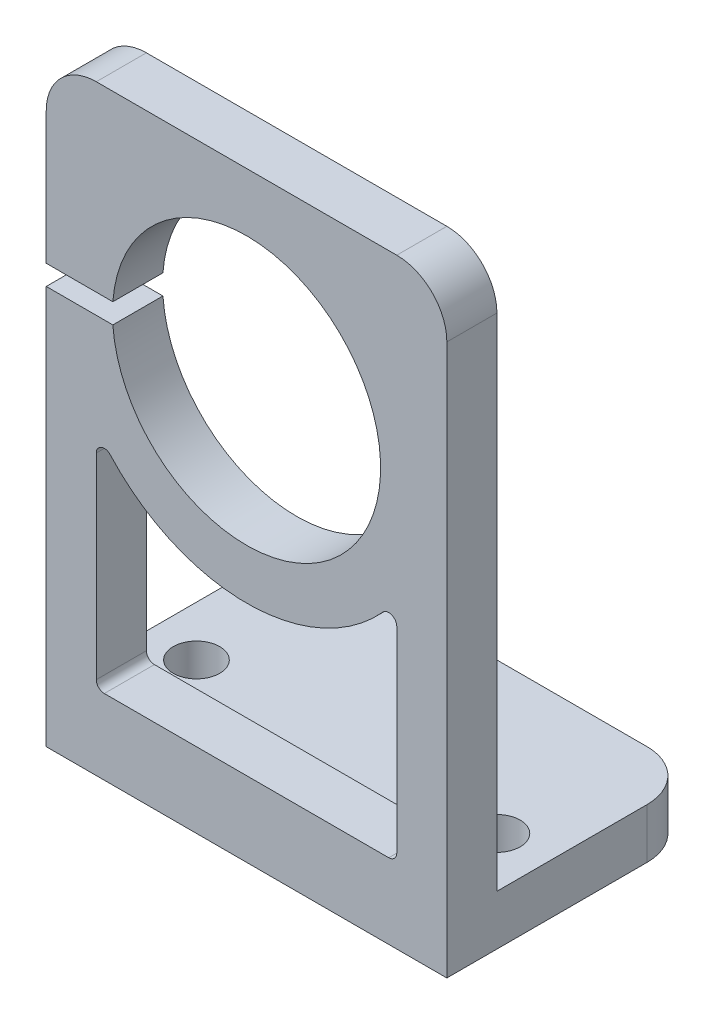
ISO-10303-21;
HEADER;
FILE_DESCRIPTION(('STEP AP214'),'2;1');
FILE_NAME('part.step','',(''),(''),'','','');
FILE_SCHEMA(('AUTOMOTIVE_DESIGN { 1 0 10303 214 1 1 1 1 }'));
ENDSEC;
DATA;
#1=APPLICATION_CONTEXT('core data for automotive mechanical design processes');
#2=APPLICATION_PROTOCOL_DEFINITION('international standard','automotive_design',2000,#1);
#3=PRODUCT_CONTEXT('',#1,'mechanical');
#4=PRODUCT('Part','Part','',(#3));
#5=PRODUCT_RELATED_PRODUCT_CATEGORY('part','',(#4));
#6=PRODUCT_DEFINITION_FORMATION('','',#4);
#7=PRODUCT_DEFINITION_CONTEXT('part definition',#1,'design');
#8=PRODUCT_DEFINITION('design','',#6,#7);
#9=PRODUCT_DEFINITION_SHAPE('','',#8);
#10=(LENGTH_UNIT() NAMED_UNIT(*) SI_UNIT(.MILLI.,.METRE.));
#11=(NAMED_UNIT(*) PLANE_ANGLE_UNIT() SI_UNIT($,.RADIAN.));
#12=(NAMED_UNIT(*) SI_UNIT($,.STERADIAN.) SOLID_ANGLE_UNIT());
#13=UNCERTAINTY_MEASURE_WITH_UNIT(LENGTH_MEASURE(1.E-05),#10,'distance_accuracy_value','');
#14=(GEOMETRIC_REPRESENTATION_CONTEXT(3) GLOBAL_UNCERTAINTY_ASSIGNED_CONTEXT((#13)) GLOBAL_UNIT_ASSIGNED_CONTEXT((#10,
#11,#12)) REPRESENTATION_CONTEXT('',''));
#15=CARTESIAN_POINT('',(0.,0.,0.));
#16=DIRECTION('',(0.,0.,1.));
#17=DIRECTION('',(1.,0.,0.));
#18=AXIS2_PLACEMENT_3D('',#15,#16,#17);
#19=CARTESIAN_POINT('',(-12.7,0.,0.));
#20=DIRECTION('',(1.,0.,0.));
#21=DIRECTION('',(0.,0.,-1.));
#22=AXIS2_PLACEMENT_3D('',#19,#20,#21);
#23=PLANE('',#22);
#24=DIRECTION('',(0.,-1.,0.));
#25=VECTOR('',#24,1.);
#26=CARTESIAN_POINT('',(-12.7,38.1,0.));
#27=LINE('',#26,#25);
#28=CARTESIAN_POINT('',(-12.7,25.273,0.));
#29=VERTEX_POINT('',#28);
#30=CARTESIAN_POINT('',(-12.7,0.,0.));
#31=VERTEX_POINT('',#30);
#32=EDGE_CURVE('E213',#29,#31,#27,.T.);
#33=ORIENTED_EDGE('',*,*,#32,.F.);
#34=DIRECTION('',(0.,0.,-1.));
#35=VECTOR('',#34,1.);
#36=CARTESIAN_POINT('',(-12.7,25.273,0.));
#37=LINE('',#36,#35);
#38=CARTESIAN_POINT('',(-12.7,25.273,-3.175));
#39=VERTEX_POINT('',#38);
#40=EDGE_CURVE('E376',#29,#39,#37,.T.);
#41=ORIENTED_EDGE('',*,*,#40,.T.);
#42=DIRECTION('',(0.,1.,0.));
#43=VECTOR('',#42,1.);
#44=CARTESIAN_POINT('',(-12.7,3.175,-3.175));
#45=LINE('',#44,#43);
#46=CARTESIAN_POINT('',(-12.7,3.175,-3.175));
#47=VERTEX_POINT('',#46);
#48=EDGE_CURVE('E223',#47,#39,#45,.T.);
#49=ORIENTED_EDGE('',*,*,#48,.F.);
#50=DIRECTION('',(0.,0.,1.));
#51=VECTOR('',#50,1.);
#52=CARTESIAN_POINT('',(-12.7,3.175,-15.875));
#53=LINE('',#52,#51);
#54=CARTESIAN_POINT('',(-12.7,3.175,-12.7));
#55=VERTEX_POINT('',#54);
#56=EDGE_CURVE('E236',#55,#47,#53,.T.);
#57=ORIENTED_EDGE('',*,*,#56,.F.);
#58=DIRECTION('',(0.,1.,0.));
#59=VECTOR('',#58,1.);
#60=CARTESIAN_POINT('',(-12.7,0.,-12.7));
#61=LINE('',#60,#59);
#62=CARTESIAN_POINT('',(-12.7,0.,-12.7));
#63=VERTEX_POINT('',#62);
#64=EDGE_CURVE('E270',#55,#63,#61,.F.);
#65=ORIENTED_EDGE('',*,*,#64,.T.);
#66=DIRECTION('',(0.,0.,-1.));
#67=VECTOR('',#66,1.);
#68=CARTESIAN_POINT('',(-12.7,0.,0.));
#69=LINE('',#68,#67);
#70=EDGE_CURVE('E233',#31,#63,#69,.T.);
#71=ORIENTED_EDGE('',*,*,#70,.F.);
#72=EDGE_LOOP('',(#33,#41,#49,#57,#65,#71));
#73=FACE_BOUND('',#72,.T.);
#74=ADVANCED_FACE('F35',(#73),#23,.F.);
#75=CARTESIAN_POINT('',(12.7,38.1,-3.175));
#76=DIRECTION('',(0.,-1.,0.));
#77=DIRECTION('',(0.,0.,-1.));
#78=AXIS2_PLACEMENT_3D('',#75,#76,#77);
#79=PLANE('',#78);
#80=DIRECTION('',(-1.,0.,0.));
#81=VECTOR('',#80,1.);
#82=CARTESIAN_POINT('',(12.7,38.1,-3.175));
#83=LINE('',#82,#81);
#84=CARTESIAN_POINT('',(9.525,38.1,-3.175));
#85=VERTEX_POINT('',#84);
#86=CARTESIAN_POINT('',(-9.525,38.1,-3.175));
#87=VERTEX_POINT('',#86);
#88=EDGE_CURVE('E231',#85,#87,#83,.T.);
#89=ORIENTED_EDGE('',*,*,#88,.T.);
#90=DIRECTION('',(0.,0.,1.));
#91=VECTOR('',#90,1.);
#92=CARTESIAN_POINT('',(-9.525,38.1,-3.175));
#93=LINE('',#92,#91);
#94=CARTESIAN_POINT('',(-9.525,38.1,0.));
#95=VERTEX_POINT('',#94);
#96=EDGE_CURVE('E284',#87,#95,#93,.T.);
#97=ORIENTED_EDGE('',*,*,#96,.T.);
#98=DIRECTION('',(-1.,0.,0.));
#99=VECTOR('',#98,1.);
#100=CARTESIAN_POINT('',(12.7,38.1,0.));
#101=LINE('',#100,#99);
#102=CARTESIAN_POINT('',(9.525,38.1,0.));
#103=VERTEX_POINT('',#102);
#104=EDGE_CURVE('E255',#103,#95,#101,.T.);
#105=ORIENTED_EDGE('',*,*,#104,.F.);
#106=DIRECTION('',(0.,0.,1.));
#107=VECTOR('',#106,1.);
#108=CARTESIAN_POINT('',(9.525,38.1,-3.175));
#109=LINE('',#108,#107);
#110=EDGE_CURVE('E282',#103,#85,#109,.F.);
#111=ORIENTED_EDGE('',*,*,#110,.T.);
#112=EDGE_LOOP('',(#89,#97,#105,#111));
#113=FACE_BOUND('',#112,.T.);
#114=ADVANCED_FACE('F440',(#113),#79,.F.);
#115=CARTESIAN_POINT('',(12.7,38.1,0.));
#116=DIRECTION('',(0.,0.,-1.));
#117=DIRECTION('',(0.,1.,0.));
#118=AXIS2_PLACEMENT_3D('',#115,#116,#117);
#119=PLANE('',#118);
#120=DIRECTION('',(0.,-1.,0.));
#121=VECTOR('',#120,1.);
#122=CARTESIAN_POINT('',(-9.525,19.1567038281527,0.));
#123=LINE('',#122,#121);
#124=CARTESIAN_POINT('',(-9.525,17.7153691649141,0.));
#125=VERTEX_POINT('',#124);
#126=CARTESIAN_POINT('',(-9.525,5.2705,0.));
#127=VERTEX_POINT('',#126);
#128=EDGE_CURVE('E361',#125,#127,#123,.T.);
#129=ORIENTED_EDGE('',*,*,#128,.F.);
#130=CARTESIAN_POINT('',(-9.017,17.7153691649141,0.));
#131=DIRECTION('',(0.,0.,-1.));
#132=DIRECTION('',(0.,1.,0.));
#133=AXIS2_PLACEMENT_3D('',#130,#131,#132);
#134=CIRCLE('',#133,0.508);
#135=CARTESIAN_POINT('',(-8.64101411803332,18.0569809571019,0.));
#136=VERTEX_POINT('',#135);
#137=EDGE_CURVE('E332',#125,#136,#134,.T.);
#138=ORIENTED_EDGE('',*,*,#137,.T.);
#139=CARTESIAN_POINT('',(0.,25.908,0.));
#140=DIRECTION('',(0.,0.,-1.));
#141=DIRECTION('',(1.,0.,0.));
#142=AXIS2_PLACEMENT_3D('',#139,#140,#141);
#143=CIRCLE('',#142,11.675);
#144=CARTESIAN_POINT('',(8.64101411803333,18.0569809571019,0.));
#145=VERTEX_POINT('',#144);
#146=EDGE_CURVE('E340',#145,#136,#143,.T.);
#147=ORIENTED_EDGE('',*,*,#146,.F.);
#148=CARTESIAN_POINT('',(9.017,17.7153691649141,0.));
#149=DIRECTION('',(0.,0.,-1.));
#150=DIRECTION('',(0.,1.,0.));
#151=AXIS2_PLACEMENT_3D('',#148,#149,#150);
#152=CIRCLE('',#151,0.508);
#153=CARTESIAN_POINT('',(9.525,17.7153691649141,0.));
#154=VERTEX_POINT('',#153);
#155=EDGE_CURVE('E43',#145,#154,#152,.T.);
#156=ORIENTED_EDGE('',*,*,#155,.T.);
#157=DIRECTION('',(0.,1.,0.));
#158=VECTOR('',#157,1.);
#159=CARTESIAN_POINT('',(9.525,4.7625,0.));
#160=LINE('',#159,#158);
#161=CARTESIAN_POINT('',(9.525,5.2705,0.));
#162=VERTEX_POINT('',#161);
#163=EDGE_CURVE('E206',#162,#154,#160,.T.);
#164=ORIENTED_EDGE('',*,*,#163,.F.);
#165=CARTESIAN_POINT('',(9.017,5.2705,0.));
#166=DIRECTION('',(0.,0.,-1.));
#167=DIRECTION('',(0.,1.,0.));
#168=AXIS2_PLACEMENT_3D('',#165,#166,#167);
#169=CIRCLE('',#168,0.508);
#170=CARTESIAN_POINT('',(9.017,4.7625,0.));
#171=VERTEX_POINT('',#170);
#172=EDGE_CURVE('E324',#162,#171,#169,.T.);
#173=ORIENTED_EDGE('',*,*,#172,.T.);
#174=DIRECTION('',(1.,0.,0.));
#175=VECTOR('',#174,1.);
#176=CARTESIAN_POINT('',(-9.525,4.7625,0.));
#177=LINE('',#176,#175);
#178=CARTESIAN_POINT('',(-9.017,4.7625,0.));
#179=VERTEX_POINT('',#178);
#180=EDGE_CURVE('E348',#179,#171,#177,.T.);
#181=ORIENTED_EDGE('',*,*,#180,.F.);
#182=CARTESIAN_POINT('',(-9.017,5.2705,0.));
#183=DIRECTION('',(0.,0.,-1.));
#184=DIRECTION('',(0.,1.,0.));
#185=AXIS2_PLACEMENT_3D('',#182,#183,#184);
#186=CIRCLE('',#185,0.508);
#187=EDGE_CURVE('E328',#179,#127,#186,.T.);
#188=ORIENTED_EDGE('',*,*,#187,.T.);
#189=EDGE_LOOP('',(#129,#138,#147,#156,#164,#173,#181,#188));
#190=FACE_BOUND('',#189,.T.);
#191=CARTESIAN_POINT('',(0.,25.908,0.));
#192=DIRECTION('',(0.,0.,1.));
#193=DIRECTION('',(1.,0.,0.));
#194=AXIS2_PLACEMENT_3D('',#191,#192,#193);
#195=CIRCLE('',#194,8.5);
#196=CARTESIAN_POINT('',(-8.47624769576727,25.273,0.));
#197=VERTEX_POINT('',#196);
#198=CARTESIAN_POINT('',(-8.47624769576727,26.543,0.));
#199=VERTEX_POINT('',#198);
#200=EDGE_CURVE('E202',#197,#199,#195,.T.);
#201=ORIENTED_EDGE('',*,*,#200,.F.);
#202=DIRECTION('',(1.,0.,0.));
#203=VECTOR('',#202,1.);
#204=CARTESIAN_POINT('',(-24.8823984595673,25.273,0.));
#205=LINE('',#204,#203);
#206=EDGE_CURVE('E205',#29,#197,#205,.T.);
#207=ORIENTED_EDGE('',*,*,#206,.F.);
#208=ORIENTED_EDGE('',*,*,#32,.T.);
#209=DIRECTION('',(-1.,0.,0.));
#210=VECTOR('',#209,1.);
#211=CARTESIAN_POINT('',(12.7,0.,0.));
#212=LINE('',#211,#210);
#213=CARTESIAN_POINT('',(12.7,0.,0.));
#214=VERTEX_POINT('',#213);
#215=EDGE_CURVE('E252',#214,#31,#212,.T.);
#216=ORIENTED_EDGE('',*,*,#215,.F.);
#217=DIRECTION('',(0.,-1.,0.));
#218=VECTOR('',#217,1.);
#219=CARTESIAN_POINT('',(12.7,38.1,0.));
#220=LINE('',#219,#218);
#221=CARTESIAN_POINT('',(12.7,34.925,0.));
#222=VERTEX_POINT('',#221);
#223=EDGE_CURVE('E220',#222,#214,#220,.T.);
#224=ORIENTED_EDGE('',*,*,#223,.F.);
#225=CARTESIAN_POINT('',(9.525,34.925,0.));
#226=DIRECTION('',(0.,0.,-1.));
#227=DIRECTION('',(0.,1.,0.));
#228=AXIS2_PLACEMENT_3D('',#225,#226,#227);
#229=CIRCLE('',#228,3.175);
#230=EDGE_CURVE('E287',#222,#103,#229,.F.);
#231=ORIENTED_EDGE('',*,*,#230,.T.);
#232=ORIENTED_EDGE('',*,*,#104,.T.);
#233=CARTESIAN_POINT('',(-9.525,34.925,0.));
#234=DIRECTION('',(0.,0.,-1.));
#235=DIRECTION('',(0.,1.,0.));
#236=AXIS2_PLACEMENT_3D('',#233,#234,#235);
#237=CIRCLE('',#236,3.175);
#238=CARTESIAN_POINT('',(-12.7,34.925,0.));
#239=VERTEX_POINT('',#238);
#240=EDGE_CURVE('E289',#95,#239,#237,.F.);
#241=ORIENTED_EDGE('',*,*,#240,.T.);
#242=CARTESIAN_POINT('',(-12.7,26.543,0.));
#243=VERTEX_POINT('',#242);
#244=EDGE_CURVE('E204',#239,#243,#27,.T.);
#245=ORIENTED_EDGE('',*,*,#244,.T.);
#246=DIRECTION('',(-1.,0.,0.));
#247=VECTOR('',#246,1.);
#248=CARTESIAN_POINT('',(-24.8823984595673,26.543,0.));
#249=LINE('',#248,#247);
#250=EDGE_CURVE('E186',#199,#243,#249,.T.);
#251=ORIENTED_EDGE('',*,*,#250,.F.);
#252=EDGE_LOOP('',(#201,#207,#208,#216,#224,#231,#232,#241,#245,#251));
#253=FACE_BOUND('',#252,.T.);
#254=ADVANCED_FACE('F200',(#190,#253),#119,.F.);
#255=CARTESIAN_POINT('',(12.7,0.,0.));
#256=DIRECTION('',(0.,1.,0.));
#257=DIRECTION('',(0.,0.,1.));
#258=AXIS2_PLACEMENT_3D('',#255,#256,#257);
#259=PLANE('',#258);
#260=CARTESIAN_POINT('',(-9.525,0.,-6.35));
#261=DIRECTION('',(0.,1.,0.));
#262=DIRECTION('',(0.,0.,1.));
#263=AXIS2_PLACEMENT_3D('',#260,#261,#262);
#264=CIRCLE('',#263,1.47319999999999);
#265=CARTESIAN_POINT('',(-9.525,0.,-4.87680000000001));
#266=VERTEX_POINT('',#265);
#267=EDGE_CURVE('E382',#266,#266,#264,.T.);
#268=ORIENTED_EDGE('',*,*,#267,.T.);
#269=EDGE_LOOP('',(#268));
#270=FACE_BOUND('',#269,.T.);
#271=CARTESIAN_POINT('',(0.,0.,-12.7));
#272=DIRECTION('',(0.,1.,0.));
#273=DIRECTION('',(0.,0.,1.));
#274=AXIS2_PLACEMENT_3D('',#271,#272,#273);
#275=CIRCLE('',#274,1.47319999999999);
#276=CARTESIAN_POINT('',(0.,0.,-11.2268));
#277=VERTEX_POINT('',#276);
#278=EDGE_CURVE('E388',#277,#277,#275,.T.);
#279=ORIENTED_EDGE('',*,*,#278,.T.);
#280=EDGE_LOOP('',(#279));
#281=FACE_BOUND('',#280,.T.);
#282=CARTESIAN_POINT('',(9.525,0.,-6.35));
#283=DIRECTION('',(0.,1.,0.));
#284=DIRECTION('',(0.,0.,1.));
#285=AXIS2_PLACEMENT_3D('',#282,#283,#284);
#286=CIRCLE('',#285,1.47319999999999);
#287=CARTESIAN_POINT('',(9.525,0.,-4.87680000000001));
#288=VERTEX_POINT('',#287);
#289=EDGE_CURVE('E211',#288,#288,#286,.T.);
#290=ORIENTED_EDGE('',*,*,#289,.T.);
#291=EDGE_LOOP('',(#290));
#292=FACE_BOUND('',#291,.T.);
#293=ORIENTED_EDGE('',*,*,#70,.T.);
#294=CARTESIAN_POINT('',(-9.525,0.,-12.7));
#295=DIRECTION('',(0.,1.,0.));
#296=DIRECTION('',(0.,0.,1.));
#297=AXIS2_PLACEMENT_3D('',#294,#295,#296);
#298=CIRCLE('',#297,3.175);
#299=CARTESIAN_POINT('',(-9.525,0.,-15.875));
#300=VERTEX_POINT('',#299);
#301=EDGE_CURVE('E274',#63,#300,#298,.F.);
#302=ORIENTED_EDGE('',*,*,#301,.T.);
#303=DIRECTION('',(-1.,0.,0.));
#304=VECTOR('',#303,1.);
#305=CARTESIAN_POINT('',(12.7,0.,-15.875));
#306=LINE('',#305,#304);
#307=CARTESIAN_POINT('',(9.525,0.,-15.875));
#308=VERTEX_POINT('',#307);
#309=EDGE_CURVE('E249',#308,#300,#306,.T.);
#310=ORIENTED_EDGE('',*,*,#309,.F.);
#311=CARTESIAN_POINT('',(9.525,0.,-12.7));
#312=DIRECTION('',(0.,1.,0.));
#313=DIRECTION('',(0.,0.,1.));
#314=AXIS2_PLACEMENT_3D('',#311,#312,#313);
#315=CIRCLE('',#314,3.175);
#316=CARTESIAN_POINT('',(12.7,0.,-12.7));
#317=VERTEX_POINT('',#316);
#318=EDGE_CURVE('E272',#308,#317,#315,.F.);
#319=ORIENTED_EDGE('',*,*,#318,.T.);
#320=DIRECTION('',(0.,0.,-1.));
#321=VECTOR('',#320,1.);
#322=CARTESIAN_POINT('',(12.7,0.,0.));
#323=LINE('',#322,#321);
#324=EDGE_CURVE('E222',#214,#317,#323,.T.);
#325=ORIENTED_EDGE('',*,*,#324,.F.);
#326=ORIENTED_EDGE('',*,*,#215,.T.);
#327=EDGE_LOOP('',(#293,#302,#310,#319,#325,#326));
#328=FACE_BOUND('',#327,.T.);
#329=ADVANCED_FACE('F414',(#270,#281,#292,#328),#259,.F.);
#330=CARTESIAN_POINT('',(12.7,0.,-15.875));
#331=DIRECTION('',(0.,0.,1.));
#332=DIRECTION('',(1.,0.,0.));
#333=AXIS2_PLACEMENT_3D('',#330,#331,#332);
#334=PLANE('',#333);
#335=ORIENTED_EDGE('',*,*,#309,.T.);
#336=DIRECTION('',(0.,1.,0.));
#337=VECTOR('',#336,1.);
#338=CARTESIAN_POINT('',(-9.525,0.,-15.875));
#339=LINE('',#338,#337);
#340=CARTESIAN_POINT('',(-9.525,3.175,-15.875));
#341=VERTEX_POINT('',#340);
#342=EDGE_CURVE('E260',#300,#341,#339,.T.);
#343=ORIENTED_EDGE('',*,*,#342,.T.);
#344=DIRECTION('',(-1.,0.,0.));
#345=VECTOR('',#344,1.);
#346=CARTESIAN_POINT('',(12.7,3.175,-15.875));
#347=LINE('',#346,#345);
#348=CARTESIAN_POINT('',(9.525,3.175,-15.875));
#349=VERTEX_POINT('',#348);
#350=EDGE_CURVE('E246',#349,#341,#347,.T.);
#351=ORIENTED_EDGE('',*,*,#350,.F.);
#352=DIRECTION('',(0.,1.,0.));
#353=VECTOR('',#352,1.);
#354=CARTESIAN_POINT('',(9.525,0.,-15.875));
#355=LINE('',#354,#353);
#356=EDGE_CURVE('E257',#349,#308,#355,.F.);
#357=ORIENTED_EDGE('',*,*,#356,.T.);
#358=EDGE_LOOP('',(#335,#343,#351,#357));
#359=FACE_BOUND('',#358,.T.);
#360=ADVANCED_FACE('F398',(#359),#334,.F.);
#361=CARTESIAN_POINT('',(12.7,3.175,-15.875));
#362=DIRECTION('',(0.,-1.,0.));
#363=DIRECTION('',(0.,0.,-1.));
#364=AXIS2_PLACEMENT_3D('',#361,#362,#363);
#365=PLANE('',#364);
#366=CARTESIAN_POINT('',(-9.525,3.175,-6.35));
#367=DIRECTION('',(0.,1.,0.));
#368=DIRECTION('',(0.,0.,1.));
#369=AXIS2_PLACEMENT_3D('',#366,#367,#368);
#370=CIRCLE('',#369,1.47319999999999);
#371=CARTESIAN_POINT('',(-9.525,3.175,-4.87680000000001));
#372=VERTEX_POINT('',#371);
#373=EDGE_CURVE('E379',#372,#372,#370,.T.);
#374=ORIENTED_EDGE('',*,*,#373,.F.);
#375=EDGE_LOOP('',(#374));
#376=FACE_BOUND('',#375,.T.);
#377=CARTESIAN_POINT('',(0.,3.175,-12.7));
#378=DIRECTION('',(0.,1.,0.));
#379=DIRECTION('',(0.,0.,1.));
#380=AXIS2_PLACEMENT_3D('',#377,#378,#379);
#381=CIRCLE('',#380,1.47319999999999);
#382=CARTESIAN_POINT('',(0.,3.175,-11.2268));
#383=VERTEX_POINT('',#382);
#384=EDGE_CURVE('E385',#383,#383,#381,.T.);
#385=ORIENTED_EDGE('',*,*,#384,.F.);
#386=EDGE_LOOP('',(#385));
#387=FACE_BOUND('',#386,.T.);
#388=CARTESIAN_POINT('',(9.525,3.175,-6.35));
#389=DIRECTION('',(0.,1.,0.));
#390=DIRECTION('',(0.,0.,1.));
#391=AXIS2_PLACEMENT_3D('',#388,#389,#390);
#392=CIRCLE('',#391,1.47319999999999);
#393=CARTESIAN_POINT('',(9.525,3.175,-4.87680000000001));
#394=VERTEX_POINT('',#393);
#395=EDGE_CURVE('E216',#394,#394,#392,.T.);
#396=ORIENTED_EDGE('',*,*,#395,.F.);
#397=EDGE_LOOP('',(#396));
#398=FACE_BOUND('',#397,.T.);
#399=ORIENTED_EDGE('',*,*,#350,.T.);
#400=CARTESIAN_POINT('',(-9.525,3.175,-12.7));
#401=DIRECTION('',(0.,-1.,0.));
#402=DIRECTION('',(0.,0.,-1.));
#403=AXIS2_PLACEMENT_3D('',#400,#401,#402);
#404=CIRCLE('',#403,3.175);
#405=EDGE_CURVE('E265',#341,#55,#404,.F.);
#406=ORIENTED_EDGE('',*,*,#405,.T.);
#407=ORIENTED_EDGE('',*,*,#56,.T.);
#408=DIRECTION('',(-1.,0.,0.));
#409=VECTOR('',#408,1.);
#410=CARTESIAN_POINT('',(12.7,3.175,-3.175));
#411=LINE('',#410,#409);
#412=CARTESIAN_POINT('',(12.7,3.175,-3.175));
#413=VERTEX_POINT('',#412);
#414=EDGE_CURVE('E243',#413,#47,#411,.T.);
#415=ORIENTED_EDGE('',*,*,#414,.F.);
#416=DIRECTION('',(0.,0.,1.));
#417=VECTOR('',#416,1.);
#418=CARTESIAN_POINT('',(12.7,3.175,-15.875));
#419=LINE('',#418,#417);
#420=CARTESIAN_POINT('',(12.7,3.175,-12.7));
#421=VERTEX_POINT('',#420);
#422=EDGE_CURVE('E226',#421,#413,#419,.T.);
#423=ORIENTED_EDGE('',*,*,#422,.F.);
#424=CARTESIAN_POINT('',(9.525,3.175,-12.7));
#425=DIRECTION('',(0.,-1.,0.));
#426=DIRECTION('',(0.,0.,-1.));
#427=AXIS2_PLACEMENT_3D('',#424,#425,#426);
#428=CIRCLE('',#427,3.175);
#429=EDGE_CURVE('E263',#421,#349,#428,.F.);
#430=ORIENTED_EDGE('',*,*,#429,.T.);
#431=EDGE_LOOP('',(#399,#406,#407,#415,#423,#430));
#432=FACE_BOUND('',#431,.T.);
#433=ADVANCED_FACE('F395',(#376,#387,#398,#432),#365,.F.);
#434=CARTESIAN_POINT('',(12.7,3.175,-3.175));
#435=DIRECTION('',(0.,0.,1.));
#436=DIRECTION('',(0.,-1.,0.));
#437=AXIS2_PLACEMENT_3D('',#434,#435,#436);
#438=PLANE('',#437);
#439=DIRECTION('',(1.,0.,0.));
#440=VECTOR('',#439,1.);
#441=CARTESIAN_POINT('',(12.7,4.7625,-3.175));
#442=LINE('',#441,#440);
#443=CARTESIAN_POINT('',(-9.01699999999999,4.7625,-3.175));
#444=VERTEX_POINT('',#443);
#445=CARTESIAN_POINT('',(9.017,4.7625,-3.175));
#446=VERTEX_POINT('',#445);
#447=EDGE_CURVE('E298',#444,#446,#442,.T.);
#448=ORIENTED_EDGE('',*,*,#447,.T.);
#449=CARTESIAN_POINT('',(9.017,5.2705,-3.175));
#450=DIRECTION('',(0.,0.,1.));
#451=DIRECTION('',(0.,-1.,0.));
#452=AXIS2_PLACEMENT_3D('',#449,#450,#451);
#453=CIRCLE('',#452,0.508);
#454=CARTESIAN_POINT('',(9.525,5.2705,-3.175));
#455=VERTEX_POINT('',#454);
#456=EDGE_CURVE('E326',#446,#455,#453,.T.);
#457=ORIENTED_EDGE('',*,*,#456,.T.);
#458=DIRECTION('',(0.,1.,0.));
#459=VECTOR('',#458,1.);
#460=CARTESIAN_POINT('',(9.525,3.175,-3.175));
#461=LINE('',#460,#459);
#462=CARTESIAN_POINT('',(9.525,17.7153691649141,-3.175));
#463=VERTEX_POINT('',#462);
#464=EDGE_CURVE('E301',#455,#463,#461,.T.);
#465=ORIENTED_EDGE('',*,*,#464,.T.);
#466=CARTESIAN_POINT('',(9.017,17.7153691649141,-3.175));
#467=DIRECTION('',(0.,0.,1.));
#468=DIRECTION('',(0.,-1.,0.));
#469=AXIS2_PLACEMENT_3D('',#466,#467,#468);
#470=CIRCLE('',#469,0.508);
#471=CARTESIAN_POINT('',(8.64101411803333,18.0569809571019,-3.175));
#472=VERTEX_POINT('',#471);
#473=EDGE_CURVE('E11',#463,#472,#470,.T.);
#474=ORIENTED_EDGE('',*,*,#473,.T.);
#475=CARTESIAN_POINT('',(0.,25.908,-3.175));
#476=DIRECTION('',(0.,0.,1.));
#477=DIRECTION('',(0.,-1.,0.));
#478=AXIS2_PLACEMENT_3D('',#475,#476,#477);
#479=CIRCLE('',#478,11.675);
#480=CARTESIAN_POINT('',(-8.64101411803332,18.0569809571019,-3.175));
#481=VERTEX_POINT('',#480);
#482=EDGE_CURVE('E303',#472,#481,#479,.F.);
#483=ORIENTED_EDGE('',*,*,#482,.T.);
#484=CARTESIAN_POINT('',(-9.017,17.7153691649141,-3.175));
#485=DIRECTION('',(0.,0.,1.));
#486=DIRECTION('',(0.,-1.,0.));
#487=AXIS2_PLACEMENT_3D('',#484,#485,#486);
#488=CIRCLE('',#487,0.508);
#489=CARTESIAN_POINT('',(-9.52499999999999,17.7153691649141,-3.175));
#490=VERTEX_POINT('',#489);
#491=EDGE_CURVE('E334',#481,#490,#488,.T.);
#492=ORIENTED_EDGE('',*,*,#491,.T.);
#493=DIRECTION('',(0.,-1.,0.));
#494=VECTOR('',#493,1.);
#495=CARTESIAN_POINT('',(-9.52499999999999,3.175,-3.175));
#496=LINE('',#495,#494);
#497=CARTESIAN_POINT('',(-9.52499999999999,5.2705,-3.175));
#498=VERTEX_POINT('',#497);
#499=EDGE_CURVE('E295',#490,#498,#496,.T.);
#500=ORIENTED_EDGE('',*,*,#499,.T.);
#501=CARTESIAN_POINT('',(-9.017,5.2705,-3.175));
#502=DIRECTION('',(0.,0.,1.));
#503=DIRECTION('',(0.,-1.,0.));
#504=AXIS2_PLACEMENT_3D('',#501,#502,#503);
#505=CIRCLE('',#504,0.508);
#506=EDGE_CURVE('E330',#498,#444,#505,.T.);
#507=ORIENTED_EDGE('',*,*,#506,.T.);
#508=EDGE_LOOP('',(#448,#457,#465,#474,#483,#492,#500,#507));
#509=FACE_BOUND('',#508,.T.);
#510=ORIENTED_EDGE('',*,*,#48,.T.);
#511=DIRECTION('',(1.,0.,0.));
#512=VECTOR('',#511,1.);
#513=CARTESIAN_POINT('',(12.7,25.273,-3.175));
#514=LINE('',#513,#512);
#515=CARTESIAN_POINT('',(-8.47624769576727,25.273,-3.175));
#516=VERTEX_POINT('',#515);
#517=EDGE_CURVE('E373',#39,#516,#514,.T.);
#518=ORIENTED_EDGE('',*,*,#517,.T.);
#519=CARTESIAN_POINT('',(0.,25.908,-3.175));
#520=DIRECTION('',(0.,0.,1.));
#521=DIRECTION('',(0.,-1.,0.));
#522=AXIS2_PLACEMENT_3D('',#519,#520,#521);
#523=CIRCLE('',#522,8.5);
#524=CARTESIAN_POINT('',(-8.47624769576727,26.543,-3.175));
#525=VERTEX_POINT('',#524);
#526=EDGE_CURVE('E210',#516,#525,#523,.T.);
#527=ORIENTED_EDGE('',*,*,#526,.T.);
#528=DIRECTION('',(-1.,0.,0.));
#529=VECTOR('',#528,1.);
#530=CARTESIAN_POINT('',(12.7,26.543,-3.175));
#531=LINE('',#530,#529);
#532=CARTESIAN_POINT('',(-12.7,26.543,-3.175));
#533=VERTEX_POINT('',#532);
#534=EDGE_CURVE('E189',#525,#533,#531,.T.);
#535=ORIENTED_EDGE('',*,*,#534,.T.);
#536=CARTESIAN_POINT('',(-12.7,34.925,-3.175));
#537=VERTEX_POINT('',#536);
#538=EDGE_CURVE('E238',#533,#537,#45,.T.);
#539=ORIENTED_EDGE('',*,*,#538,.T.);
#540=CARTESIAN_POINT('',(-9.525,34.925,-3.175));
#541=DIRECTION('',(0.,0.,1.));
#542=DIRECTION('',(0.,-1.,0.));
#543=AXIS2_PLACEMENT_3D('',#540,#541,#542);
#544=CIRCLE('',#543,3.175);
#545=EDGE_CURVE('E195',#537,#87,#544,.F.);
#546=ORIENTED_EDGE('',*,*,#545,.T.);
#547=ORIENTED_EDGE('',*,*,#88,.F.);
#548=CARTESIAN_POINT('',(9.525,34.925,-3.175));
#549=DIRECTION('',(0.,0.,1.));
#550=DIRECTION('',(0.,-1.,0.));
#551=AXIS2_PLACEMENT_3D('',#548,#549,#550);
#552=CIRCLE('',#551,3.175);
#553=CARTESIAN_POINT('',(12.7,34.925,-3.175));
#554=VERTEX_POINT('',#553);
#555=EDGE_CURVE('E291',#85,#554,#552,.F.);
#556=ORIENTED_EDGE('',*,*,#555,.T.);
#557=DIRECTION('',(0.,1.,0.));
#558=VECTOR('',#557,1.);
#559=CARTESIAN_POINT('',(12.7,3.175,-3.175));
#560=LINE('',#559,#558);
#561=EDGE_CURVE('E228',#413,#554,#560,.T.);
#562=ORIENTED_EDGE('',*,*,#561,.F.);
#563=ORIENTED_EDGE('',*,*,#414,.T.);
#564=EDGE_LOOP('',(#510,#518,#527,#535,#539,#546,#547,#556,#562,#563));
#565=FACE_BOUND('',#564,.T.);
#566=ADVANCED_FACE('F352',(#509,#565),#438,.F.);
#567=CARTESIAN_POINT('',(12.7,0.,0.));
#568=DIRECTION('',(1.,0.,0.));
#569=DIRECTION('',(0.,0.,-1.));
#570=AXIS2_PLACEMENT_3D('',#567,#568,#569);
#571=PLANE('',#570);
#572=ORIENTED_EDGE('',*,*,#324,.T.);
#573=DIRECTION('',(0.,1.,0.));
#574=VECTOR('',#573,1.);
#575=CARTESIAN_POINT('',(12.7,3.175,-12.7));
#576=LINE('',#575,#574);
#577=EDGE_CURVE('E279',#317,#421,#576,.T.);
#578=ORIENTED_EDGE('',*,*,#577,.T.);
#579=ORIENTED_EDGE('',*,*,#422,.T.);
#580=ORIENTED_EDGE('',*,*,#561,.T.);
#581=DIRECTION('',(0.,0.,1.));
#582=VECTOR('',#581,1.);
#583=CARTESIAN_POINT('',(12.7,34.925,0.));
#584=LINE('',#583,#582);
#585=EDGE_CURVE('E276',#554,#222,#584,.T.);
#586=ORIENTED_EDGE('',*,*,#585,.T.);
#587=ORIENTED_EDGE('',*,*,#223,.T.);
#588=EDGE_LOOP('',(#572,#578,#579,#580,#586,#587));
#589=FACE_BOUND('',#588,.T.);
#590=ADVANCED_FACE('F416',(#589),#571,.T.);
#591=ORIENTED_EDGE('',*,*,#538,.F.);
#592=DIRECTION('',(0.,0.,1.));
#593=VECTOR('',#592,1.);
#594=CARTESIAN_POINT('',(-12.7,26.543,0.));
#595=LINE('',#594,#593);
#596=EDGE_CURVE('E371',#533,#243,#595,.T.);
#597=ORIENTED_EDGE('',*,*,#596,.T.);
#598=ORIENTED_EDGE('',*,*,#244,.F.);
#599=DIRECTION('',(0.,0.,1.));
#600=VECTOR('',#599,1.);
#601=CARTESIAN_POINT('',(-12.7,34.925,0.));
#602=LINE('',#601,#600);
#603=EDGE_CURVE('E267',#239,#537,#602,.F.);
#604=ORIENTED_EDGE('',*,*,#603,.T.);
#605=EDGE_LOOP('',(#591,#597,#598,#604));
#606=FACE_BOUND('',#605,.T.);
#607=ADVANCED_FACE('F436',(#606),#23,.F.);
#608=CARTESIAN_POINT('',(0.,25.908,-15.875));
#609=DIRECTION('',(0.,0.,1.));
#610=DIRECTION('',(1.,0.,0.));
#611=AXIS2_PLACEMENT_3D('',#608,#609,#610);
#612=CYLINDRICAL_SURFACE('',#611,8.5);
#613=ORIENTED_EDGE('',*,*,#526,.F.);
#614=DIRECTION('',(0.,0.,1.));
#615=VECTOR('',#614,1.);
#616=CARTESIAN_POINT('',(-8.47624769576727,25.273,-15.875));
#617=LINE('',#616,#615);
#618=EDGE_CURVE('E194',#516,#197,#617,.T.);
#619=ORIENTED_EDGE('',*,*,#618,.T.);
#620=ORIENTED_EDGE('',*,*,#200,.T.);
#621=DIRECTION('',(0.,0.,1.));
#622=VECTOR('',#621,1.);
#623=CARTESIAN_POINT('',(-8.47624769576727,26.543,-15.875));
#624=LINE('',#623,#622);
#625=EDGE_CURVE('E183',#199,#525,#624,.F.);
#626=ORIENTED_EDGE('',*,*,#625,.T.);
#627=EDGE_LOOP('',(#613,#619,#620,#626));
#628=FACE_BOUND('',#627,.T.);
#629=ADVANCED_FACE('F209',(#628),#612,.F.);
#630=CARTESIAN_POINT('',(-9.525,0.,-12.7));
#631=DIRECTION('',(0.,1.,0.));
#632=DIRECTION('',(0.,0.,1.));
#633=AXIS2_PLACEMENT_3D('',#630,#631,#632);
#634=CYLINDRICAL_SURFACE('',#633,3.175);
#635=ORIENTED_EDGE('',*,*,#301,.F.);
#636=ORIENTED_EDGE('',*,*,#64,.F.);
#637=ORIENTED_EDGE('',*,*,#405,.F.);
#638=ORIENTED_EDGE('',*,*,#342,.F.);
#639=EDGE_LOOP('',(#635,#636,#637,#638));
#640=FACE_BOUND('',#639,.T.);
#641=ADVANCED_FACE('F427',(#640),#634,.T.);
#642=CARTESIAN_POINT('',(9.525,0.,-12.7));
#643=DIRECTION('',(0.,-1.,0.));
#644=DIRECTION('',(0.,0.,-1.));
#645=AXIS2_PLACEMENT_3D('',#642,#643,#644);
#646=CYLINDRICAL_SURFACE('',#645,3.175);
#647=ORIENTED_EDGE('',*,*,#318,.F.);
#648=ORIENTED_EDGE('',*,*,#356,.F.);
#649=ORIENTED_EDGE('',*,*,#429,.F.);
#650=ORIENTED_EDGE('',*,*,#577,.F.);
#651=EDGE_LOOP('',(#647,#648,#649,#650));
#652=FACE_BOUND('',#651,.T.);
#653=ADVANCED_FACE('F410',(#652),#646,.T.);
#654=CARTESIAN_POINT('',(-9.525,34.925,-3.175));
#655=DIRECTION('',(0.,0.,1.));
#656=DIRECTION('',(1.,0.,0.));
#657=AXIS2_PLACEMENT_3D('',#654,#655,#656);
#658=CYLINDRICAL_SURFACE('',#657,3.175);
#659=ORIENTED_EDGE('',*,*,#545,.F.);
#660=ORIENTED_EDGE('',*,*,#603,.F.);
#661=ORIENTED_EDGE('',*,*,#240,.F.);
#662=ORIENTED_EDGE('',*,*,#96,.F.);
#663=EDGE_LOOP('',(#659,#660,#661,#662));
#664=FACE_BOUND('',#663,.T.);
#665=ADVANCED_FACE('F434',(#664),#658,.T.);
#666=CARTESIAN_POINT('',(9.525,34.925,0.));
#667=DIRECTION('',(0.,0.,-1.));
#668=DIRECTION('',(-1.,0.,0.));
#669=AXIS2_PLACEMENT_3D('',#666,#667,#668);
#670=CYLINDRICAL_SURFACE('',#669,3.175);
#671=ORIENTED_EDGE('',*,*,#555,.F.);
#672=ORIENTED_EDGE('',*,*,#110,.F.);
#673=ORIENTED_EDGE('',*,*,#230,.F.);
#674=ORIENTED_EDGE('',*,*,#585,.F.);
#675=EDGE_LOOP('',(#671,#672,#673,#674));
#676=FACE_BOUND('',#675,.T.);
#677=ADVANCED_FACE('F478',(#676),#670,.T.);
#678=CARTESIAN_POINT('',(9.525,3.175,-6.35));
#679=DIRECTION('',(0.,1.,0.));
#680=DIRECTION('',(0.,0.,1.));
#681=AXIS2_PLACEMENT_3D('',#678,#679,#680);
#682=CYLINDRICAL_SURFACE('',#681,1.47319999999999);
#683=ORIENTED_EDGE('',*,*,#289,.F.);
#684=EDGE_LOOP('',(#683));
#685=FACE_BOUND('',#684,.T.);
#686=ORIENTED_EDGE('',*,*,#395,.T.);
#687=EDGE_LOOP('',(#686));
#688=FACE_BOUND('',#687,.T.);
#689=ADVANCED_FACE('F393',(#685,#688),#682,.F.);
#690=CARTESIAN_POINT('',(0.,3.175,-12.7));
#691=DIRECTION('',(0.,1.,0.));
#692=DIRECTION('',(0.,0.,1.));
#693=AXIS2_PLACEMENT_3D('',#690,#691,#692);
#694=CYLINDRICAL_SURFACE('',#693,1.47319999999999);
#695=ORIENTED_EDGE('',*,*,#278,.F.);
#696=EDGE_LOOP('',(#695));
#697=FACE_BOUND('',#696,.T.);
#698=ORIENTED_EDGE('',*,*,#384,.T.);
#699=EDGE_LOOP('',(#698));
#700=FACE_BOUND('',#699,.T.);
#701=ADVANCED_FACE('F472',(#697,#700),#694,.F.);
#702=CARTESIAN_POINT('',(-9.525,3.175,-6.35));
#703=DIRECTION('',(0.,1.,0.));
#704=DIRECTION('',(0.,0.,1.));
#705=AXIS2_PLACEMENT_3D('',#702,#703,#704);
#706=CYLINDRICAL_SURFACE('',#705,1.47319999999999);
#707=ORIENTED_EDGE('',*,*,#267,.F.);
#708=EDGE_LOOP('',(#707));
#709=FACE_BOUND('',#708,.T.);
#710=ORIENTED_EDGE('',*,*,#373,.T.);
#711=EDGE_LOOP('',(#710));
#712=FACE_BOUND('',#711,.T.);
#713=ADVANCED_FACE('F466',(#709,#712),#706,.F.);
#714=CARTESIAN_POINT('',(-24.8823984595673,26.543,-15.875));
#715=DIRECTION('',(0.,1.,0.));
#716=DIRECTION('',(-1.,0.,0.));
#717=AXIS2_PLACEMENT_3D('',#714,#715,#716);
#718=PLANE('',#717);
#719=ORIENTED_EDGE('',*,*,#534,.F.);
#720=ORIENTED_EDGE('',*,*,#625,.F.);
#721=ORIENTED_EDGE('',*,*,#250,.T.);
#722=ORIENTED_EDGE('',*,*,#596,.F.);
#723=EDGE_LOOP('',(#719,#720,#721,#722));
#724=FACE_BOUND('',#723,.T.);
#725=ADVANCED_FACE('F185',(#724),#718,.F.);
#726=CARTESIAN_POINT('',(-24.8823984595673,25.273,-15.875));
#727=DIRECTION('',(0.,-1.,0.));
#728=DIRECTION('',(0.,0.,-1.));
#729=AXIS2_PLACEMENT_3D('',#726,#727,#728);
#730=PLANE('',#729);
#731=ORIENTED_EDGE('',*,*,#206,.T.);
#732=ORIENTED_EDGE('',*,*,#618,.F.);
#733=ORIENTED_EDGE('',*,*,#517,.F.);
#734=ORIENTED_EDGE('',*,*,#40,.F.);
#735=EDGE_LOOP('',(#731,#732,#733,#734));
#736=FACE_BOUND('',#735,.T.);
#737=ADVANCED_FACE('F458',(#736),#730,.F.);
#738=CARTESIAN_POINT('',(0.,25.908,-15.875));
#739=DIRECTION('',(0.,0.,1.));
#740=DIRECTION('',(1.,0.,0.));
#741=AXIS2_PLACEMENT_3D('',#738,#739,#740);
#742=CYLINDRICAL_SURFACE('',#741,11.675);
#743=ORIENTED_EDGE('',*,*,#146,.T.);
#744=DIRECTION('',(0.,0.,1.));
#745=VECTOR('',#744,1.);
#746=CARTESIAN_POINT('',(-8.64101411803332,18.0569809571019,-15.875));
#747=LINE('',#746,#745);
#748=EDGE_CURVE('E50',#136,#481,#747,.F.);
#749=ORIENTED_EDGE('',*,*,#748,.T.);
#750=ORIENTED_EDGE('',*,*,#482,.F.);
#751=DIRECTION('',(0.,0.,1.));
#752=VECTOR('',#751,1.);
#753=CARTESIAN_POINT('',(8.64101411803333,18.0569809571019,-15.875));
#754=LINE('',#753,#752);
#755=EDGE_CURVE('E320',#472,#145,#754,.T.);
#756=ORIENTED_EDGE('',*,*,#755,.T.);
#757=EDGE_LOOP('',(#743,#749,#750,#756));
#758=FACE_BOUND('',#757,.T.);
#759=ADVANCED_FACE('F350',(#758),#742,.T.);
#760=CARTESIAN_POINT('',(9.525,4.7625,-15.875));
#761=DIRECTION('',(1.,0.,0.));
#762=DIRECTION('',(0.,0.,-1.));
#763=AXIS2_PLACEMENT_3D('',#760,#761,#762);
#764=PLANE('',#763);
#765=ORIENTED_EDGE('',*,*,#464,.F.);
#766=DIRECTION('',(0.,0.,1.));
#767=VECTOR('',#766,1.);
#768=CARTESIAN_POINT('',(9.525,5.2705,0.));
#769=LINE('',#768,#767);
#770=EDGE_CURVE('E307',#455,#162,#769,.T.);
#771=ORIENTED_EDGE('',*,*,#770,.T.);
#772=ORIENTED_EDGE('',*,*,#163,.T.);
#773=DIRECTION('',(0.,0.,-1.));
#774=VECTOR('',#773,1.);
#775=CARTESIAN_POINT('',(9.525,17.7153691649141,-3.175));
#776=LINE('',#775,#774);
#777=EDGE_CURVE('E305',#154,#463,#776,.T.);
#778=ORIENTED_EDGE('',*,*,#777,.T.);
#779=EDGE_LOOP('',(#765,#771,#772,#778));
#780=FACE_BOUND('',#779,.T.);
#781=ADVANCED_FACE('F346',(#780),#764,.F.);
#782=CARTESIAN_POINT('',(-9.525,4.7625,-15.875));
#783=DIRECTION('',(0.,-1.,0.));
#784=DIRECTION('',(0.,0.,-1.));
#785=AXIS2_PLACEMENT_3D('',#782,#783,#784);
#786=PLANE('',#785);
#787=ORIENTED_EDGE('',*,*,#180,.T.);
#788=DIRECTION('',(0.,0.,1.));
#789=VECTOR('',#788,1.);
#790=CARTESIAN_POINT('',(9.017,4.7625,-3.175));
#791=LINE('',#790,#789);
#792=EDGE_CURVE('E313',#171,#446,#791,.F.);
#793=ORIENTED_EDGE('',*,*,#792,.T.);
#794=ORIENTED_EDGE('',*,*,#447,.F.);
#795=DIRECTION('',(0.,0.,1.));
#796=VECTOR('',#795,1.);
#797=CARTESIAN_POINT('',(-9.017,4.7625,0.));
#798=LINE('',#797,#796);
#799=EDGE_CURVE('E310',#444,#179,#798,.T.);
#800=ORIENTED_EDGE('',*,*,#799,.T.);
#801=EDGE_LOOP('',(#787,#793,#794,#800));
#802=FACE_BOUND('',#801,.T.);
#803=ADVANCED_FACE('F609',(#802),#786,.F.);
#804=CARTESIAN_POINT('',(-9.525,19.1567038281527,-15.875));
#805=DIRECTION('',(-1.,0.,0.));
#806=DIRECTION('',(0.,-1.,0.));
#807=AXIS2_PLACEMENT_3D('',#804,#805,#806);
#808=PLANE('',#807);
#809=ORIENTED_EDGE('',*,*,#128,.T.);
#810=DIRECTION('',(0.,0.,1.));
#811=VECTOR('',#810,1.);
#812=CARTESIAN_POINT('',(-9.525,5.2705,-3.175));
#813=LINE('',#812,#811);
#814=EDGE_CURVE('E318',#127,#498,#813,.F.);
#815=ORIENTED_EDGE('',*,*,#814,.T.);
#816=ORIENTED_EDGE('',*,*,#499,.F.);
#817=DIRECTION('',(0.,0.,-1.));
#818=VECTOR('',#817,1.);
#819=CARTESIAN_POINT('',(-9.525,17.7153691649141,0.));
#820=LINE('',#819,#818);
#821=EDGE_CURVE('E315',#490,#125,#820,.F.);
#822=ORIENTED_EDGE('',*,*,#821,.T.);
#823=EDGE_LOOP('',(#809,#815,#816,#822));
#824=FACE_BOUND('',#823,.T.);
#825=ADVANCED_FACE('F360',(#824),#808,.F.);
#826=CARTESIAN_POINT('',(9.017,5.2705,-15.875));
#827=DIRECTION('',(0.,0.,-1.));
#828=DIRECTION('',(-1.,0.,0.));
#829=AXIS2_PLACEMENT_3D('',#826,#827,#828);
#830=CYLINDRICAL_SURFACE('',#829,0.508);
#831=ORIENTED_EDGE('',*,*,#456,.F.);
#832=ORIENTED_EDGE('',*,*,#792,.F.);
#833=ORIENTED_EDGE('',*,*,#172,.F.);
#834=ORIENTED_EDGE('',*,*,#770,.F.);
#835=EDGE_LOOP('',(#831,#832,#833,#834));
#836=FACE_BOUND('',#835,.T.);
#837=ADVANCED_FACE('F625',(#836),#830,.F.);
#838=CARTESIAN_POINT('',(-9.017,5.2705,-15.875));
#839=DIRECTION('',(0.,0.,-1.));
#840=DIRECTION('',(-1.,0.,0.));
#841=AXIS2_PLACEMENT_3D('',#838,#839,#840);
#842=CYLINDRICAL_SURFACE('',#841,0.508);
#843=ORIENTED_EDGE('',*,*,#506,.F.);
#844=ORIENTED_EDGE('',*,*,#814,.F.);
#845=ORIENTED_EDGE('',*,*,#187,.F.);
#846=ORIENTED_EDGE('',*,*,#799,.F.);
#847=EDGE_LOOP('',(#843,#844,#845,#846));
#848=FACE_BOUND('',#847,.T.);
#849=ADVANCED_FACE('F632',(#848),#842,.F.);
#850=CARTESIAN_POINT('',(-9.017,17.7153691649141,-15.875));
#851=DIRECTION('',(0.,0.,1.));
#852=DIRECTION('',(1.,0.,0.));
#853=AXIS2_PLACEMENT_3D('',#850,#851,#852);
#854=CYLINDRICAL_SURFACE('',#853,0.508);
#855=ORIENTED_EDGE('',*,*,#491,.F.);
#856=ORIENTED_EDGE('',*,*,#748,.F.);
#857=ORIENTED_EDGE('',*,*,#137,.F.);
#858=ORIENTED_EDGE('',*,*,#821,.F.);
#859=EDGE_LOOP('',(#855,#856,#857,#858));
#860=FACE_BOUND('',#859,.T.);
#861=ADVANCED_FACE('F357',(#860),#854,.F.);
#862=CARTESIAN_POINT('',(9.017,17.7153691649141,-15.875));
#863=DIRECTION('',(0.,0.,1.));
#864=DIRECTION('',(1.,0.,0.));
#865=AXIS2_PLACEMENT_3D('',#862,#863,#864);
#866=CYLINDRICAL_SURFACE('',#865,0.508);
#867=ORIENTED_EDGE('',*,*,#473,.F.);
#868=ORIENTED_EDGE('',*,*,#777,.F.);
#869=ORIENTED_EDGE('',*,*,#155,.F.);
#870=ORIENTED_EDGE('',*,*,#755,.F.);
#871=EDGE_LOOP('',(#867,#868,#869,#870));
#872=FACE_BOUND('',#871,.T.);
#873=ADVANCED_FACE('F37',(#872),#866,.F.);
#874=CLOSED_SHELL('',(#74,#114,#254,#329,#360,#433,#566,#590,#607,#629,#641,#653,#665,#677,#689,
#701,#713,#725,#737,#759,#781,#803,#825,#837,#849,#861,#873));
#875=MANIFOLD_SOLID_BREP('B2',#874);
#876=ADVANCED_BREP_SHAPE_REPRESENTATION('',(#18,#875),#14);
#877=SHAPE_DEFINITION_REPRESENTATION(#9,#876);
ENDSEC;
END-ISO-10303-21;
